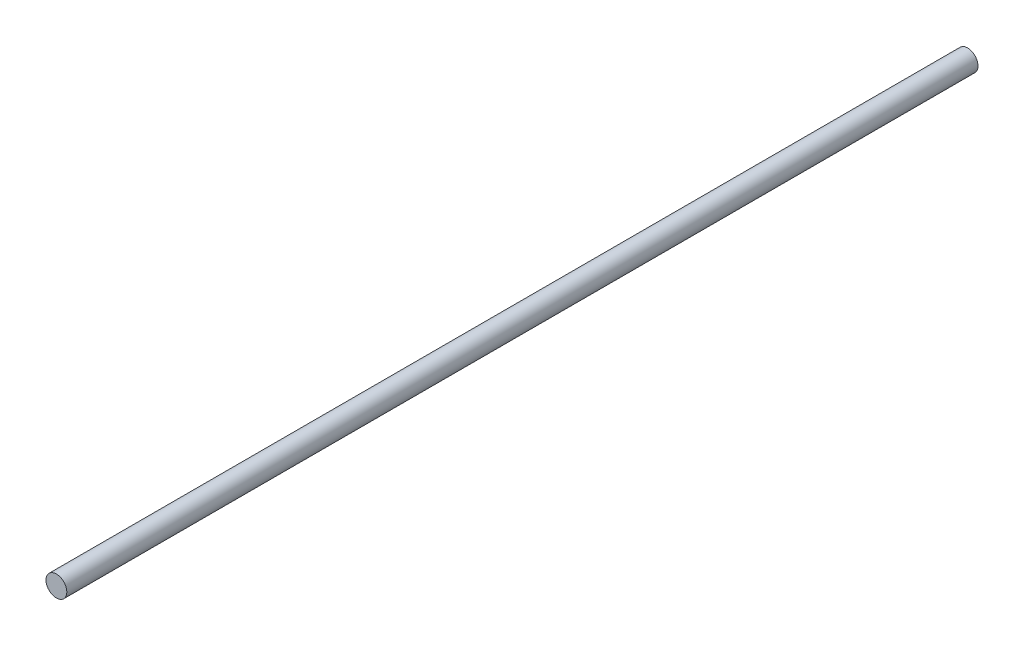
ISO-10303-21;
HEADER;
FILE_DESCRIPTION(('STEP AP214'),'2;1');
FILE_NAME('part.step','',(''),(''),'','','');
FILE_SCHEMA(('AUTOMOTIVE_DESIGN { 1 0 10303 214 1 1 1 1 }'));
ENDSEC;
DATA;
#1=APPLICATION_CONTEXT('core data for automotive mechanical design processes');
#2=APPLICATION_PROTOCOL_DEFINITION('international standard','automotive_design',2000,#1);
#3=PRODUCT_CONTEXT('',#1,'mechanical');
#4=PRODUCT('Part','Part','',(#3));
#5=PRODUCT_RELATED_PRODUCT_CATEGORY('part','',(#4));
#6=PRODUCT_DEFINITION_FORMATION('','',#4);
#7=PRODUCT_DEFINITION_CONTEXT('part definition',#1,'design');
#8=PRODUCT_DEFINITION('design','',#6,#7);
#9=PRODUCT_DEFINITION_SHAPE('','',#8);
#10=(LENGTH_UNIT() NAMED_UNIT(*) SI_UNIT(.MILLI.,.METRE.));
#11=(NAMED_UNIT(*) PLANE_ANGLE_UNIT() SI_UNIT($,.RADIAN.));
#12=(NAMED_UNIT(*) SI_UNIT($,.STERADIAN.) SOLID_ANGLE_UNIT());
#13=UNCERTAINTY_MEASURE_WITH_UNIT(LENGTH_MEASURE(1.E-05),#10,'distance_accuracy_value','');
#14=(GEOMETRIC_REPRESENTATION_CONTEXT(3) GLOBAL_UNCERTAINTY_ASSIGNED_CONTEXT((#13)) GLOBAL_UNIT_ASSIGNED_CONTEXT((#10,
#11,#12)) REPRESENTATION_CONTEXT('',''));
#15=CARTESIAN_POINT('',(0.,0.,0.));
#16=DIRECTION('',(0.,0.,1.));
#17=DIRECTION('',(1.,0.,0.));
#18=AXIS2_PLACEMENT_3D('',#15,#16,#17);
#19=CARTESIAN_POINT('',(0.,0.,350.));
#20=DIRECTION('',(0.,0.,-1.));
#21=DIRECTION('',(-1.,0.,0.));
#22=AXIS2_PLACEMENT_3D('',#19,#20,#21);
#23=CYLINDRICAL_SURFACE('',#22,4.);
#24=CARTESIAN_POINT('',(0.,0.,350.));
#25=DIRECTION('',(0.,0.,1.));
#26=DIRECTION('',(1.,0.,0.));
#27=AXIS2_PLACEMENT_3D('',#24,#25,#26);
#28=CIRCLE('',#27,4.);
#29=CARTESIAN_POINT('',(4.,0.,350.));
#30=VERTEX_POINT('',#29);
#31=EDGE_CURVE('E10',#30,#30,#28,.T.);
#32=ORIENTED_EDGE('',*,*,#31,.F.);
#33=EDGE_LOOP('',(#32));
#34=FACE_BOUND('',#33,.T.);
#35=CARTESIAN_POINT('',(0.,0.,0.));
#36=DIRECTION('',(0.,0.,1.));
#37=DIRECTION('',(1.,0.,0.));
#38=AXIS2_PLACEMENT_3D('',#35,#36,#37);
#39=CIRCLE('',#38,4.);
#40=CARTESIAN_POINT('',(4.,0.,0.));
#41=VERTEX_POINT('',#40);
#42=EDGE_CURVE('E32',#41,#41,#39,.T.);
#43=ORIENTED_EDGE('',*,*,#42,.T.);
#44=EDGE_LOOP('',(#43));
#45=FACE_BOUND('',#44,.T.);
#46=ADVANCED_FACE('F29',(#34,#45),#23,.T.);
#47=CARTESIAN_POINT('',(0.,0.,350.));
#48=DIRECTION('',(0.,0.,1.));
#49=DIRECTION('',(1.,0.,0.));
#50=AXIS2_PLACEMENT_3D('',#47,#48,#49);
#51=PLANE('',#50);
#52=ORIENTED_EDGE('',*,*,#31,.T.);
#53=EDGE_LOOP('',(#52));
#54=FACE_BOUND('',#53,.T.);
#55=ADVANCED_FACE('F44',(#54),#51,.T.);
#56=CARTESIAN_POINT('',(0.,0.,0.));
#57=DIRECTION('',(0.,0.,1.));
#58=DIRECTION('',(1.,0.,0.));
#59=AXIS2_PLACEMENT_3D('',#56,#57,#58);
#60=PLANE('',#59);
#61=ORIENTED_EDGE('',*,*,#42,.F.);
#62=EDGE_LOOP('',(#61));
#63=FACE_BOUND('',#62,.T.);
#64=ADVANCED_FACE('F42',(#63),#60,.F.);
#65=CLOSED_SHELL('',(#46,#55,#64));
#66=MANIFOLD_SOLID_BREP('B2',#65);
#67=ADVANCED_BREP_SHAPE_REPRESENTATION('',(#18,#66),#14);
#68=SHAPE_DEFINITION_REPRESENTATION(#9,#67);
ENDSEC;
END-ISO-10303-21;
